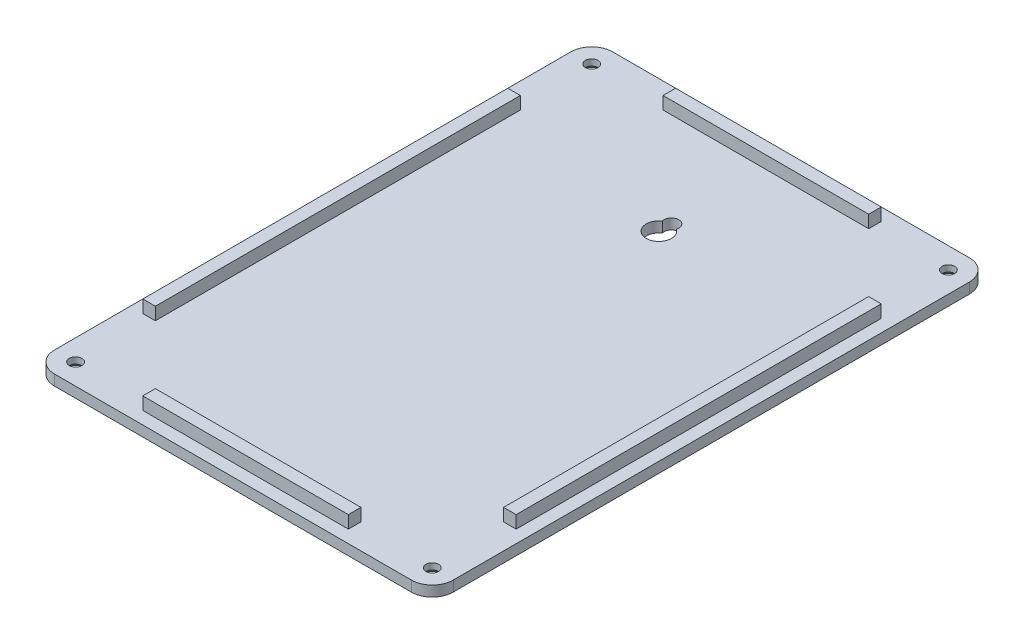
ISO-10303-21;
HEADER;
FILE_DESCRIPTION(('STEP AP214'),'2;1');
FILE_NAME('part.step','',(''),(''),'','','');
FILE_SCHEMA(('AUTOMOTIVE_DESIGN { 1 0 10303 214 1 1 1 1 }'));
ENDSEC;
DATA;
#1=APPLICATION_CONTEXT('core data for automotive mechanical design processes');
#2=APPLICATION_PROTOCOL_DEFINITION('international standard','automotive_design',2000,#1);
#3=PRODUCT_CONTEXT('',#1,'mechanical');
#4=PRODUCT('Part','Part','',(#3));
#5=PRODUCT_RELATED_PRODUCT_CATEGORY('part','',(#4));
#6=PRODUCT_DEFINITION_FORMATION('','',#4);
#7=PRODUCT_DEFINITION_CONTEXT('part definition',#1,'design');
#8=PRODUCT_DEFINITION('design','',#6,#7);
#9=PRODUCT_DEFINITION_SHAPE('','',#8);
#10=(LENGTH_UNIT() NAMED_UNIT(*) SI_UNIT(.MILLI.,.METRE.));
#11=(NAMED_UNIT(*) PLANE_ANGLE_UNIT() SI_UNIT($,.RADIAN.));
#12=(NAMED_UNIT(*) SI_UNIT($,.STERADIAN.) SOLID_ANGLE_UNIT());
#13=UNCERTAINTY_MEASURE_WITH_UNIT(LENGTH_MEASURE(1.E-05),#10,'distance_accuracy_value','');
#14=(GEOMETRIC_REPRESENTATION_CONTEXT(3) GLOBAL_UNCERTAINTY_ASSIGNED_CONTEXT((#13)) GLOBAL_UNIT_ASSIGNED_CONTEXT((#10,
#11,#12)) REPRESENTATION_CONTEXT('',''));
#15=CARTESIAN_POINT('',(0.,0.,0.));
#16=DIRECTION('',(0.,0.,1.));
#17=DIRECTION('',(1.,0.,0.));
#18=AXIS2_PLACEMENT_3D('',#15,#16,#17);
#19=CARTESIAN_POINT('',(-42.4999999999909,2.5,61.4999999999953));
#20=DIRECTION('',(0.,-1.,0.));
#21=DIRECTION('',(0.,0.,-1.));
#22=AXIS2_PLACEMENT_3D('',#19,#20,#21);
#23=PLANE('',#22);
#24=CARTESIAN_POINT('',(0.,2.5,-37.9999999999983));
#25=DIRECTION('',(0.,1.,0.));
#26=DIRECTION('',(0.,0.,-1.));
#27=AXIS2_PLACEMENT_3D('',#24,#25,#26);
#28=CIRCLE('',#27,1.75);
#29=CARTESIAN_POINT('',(1.67391004130708,2.5,-37.4895833333316));
#30=VERTEX_POINT('',#29);
#31=CARTESIAN_POINT('',(-1.67391004130721,2.5,-37.4895833333316));
#32=VERTEX_POINT('',#31);
#33=EDGE_CURVE('E212',#30,#32,#28,.T.);
#34=ORIENTED_EDGE('',*,*,#33,.F.);
#35=CARTESIAN_POINT('',(0.,2.5,-34.9999999999983));
#36=DIRECTION('',(0.,1.,0.));
#37=DIRECTION('',(0.,0.,1.));
#38=AXIS2_PLACEMENT_3D('',#35,#36,#37);
#39=CIRCLE('',#38,3.);
#40=EDGE_CURVE('E48',#32,#30,#39,.T.);
#41=ORIENTED_EDGE('',*,*,#40,.F.);
#42=EDGE_LOOP('',(#34,#41));
#43=FACE_BOUND('',#42,.T.);
#44=DIRECTION('',(-1.,0.,0.));
#45=VECTOR('',#44,1.);
#46=CARTESIAN_POINT('',(-44.4999999999933,2.5,-43.4999999999949));
#47=LINE('',#46,#45);
#48=CARTESIAN_POINT('',(-41.4999999999933,2.5,-43.4999999999949));
#49=VERTEX_POINT('',#48);
#50=CARTESIAN_POINT('',(-44.4999999999933,2.5,-43.4999999999949));
#51=VERTEX_POINT('',#50);
#52=EDGE_CURVE('E252',#49,#51,#47,.T.);
#53=ORIENTED_EDGE('',*,*,#52,.F.);
#54=DIRECTION('',(0.,0.,-1.));
#55=VECTOR('',#54,1.);
#56=CARTESIAN_POINT('',(-41.4999999999933,2.5,-43.4999999999949));
#57=LINE('',#56,#55);
#58=CARTESIAN_POINT('',(-41.4999999999933,2.5,43.4999999999949));
#59=VERTEX_POINT('',#58);
#60=EDGE_CURVE('E257',#59,#49,#57,.T.);
#61=ORIENTED_EDGE('',*,*,#60,.F.);
#62=DIRECTION('',(1.,0.,0.));
#63=VECTOR('',#62,1.);
#64=CARTESIAN_POINT('',(-44.4999999999933,2.5,43.4999999999949));
#65=LINE('',#64,#63);
#66=CARTESIAN_POINT('',(-44.4999999999933,2.5,43.4999999999949));
#67=VERTEX_POINT('',#66);
#68=EDGE_CURVE('E269',#67,#59,#65,.T.);
#69=ORIENTED_EDGE('',*,*,#68,.F.);
#70=DIRECTION('',(0.,0.,1.));
#71=VECTOR('',#70,1.);
#72=CARTESIAN_POINT('',(-44.4999999999933,2.5,-43.4999999999949));
#73=LINE('',#72,#71);
#74=EDGE_CURVE('E266',#51,#67,#73,.T.);
#75=ORIENTED_EDGE('',*,*,#74,.F.);
#76=EDGE_LOOP('',(#53,#61,#69,#75));
#77=FACE_BOUND('',#76,.T.);
#78=DIRECTION('',(0.,0.,1.));
#79=VECTOR('',#78,1.);
#80=CARTESIAN_POINT('',(-24.4999999999882,2.5,-63.5000000000001));
#81=LINE('',#80,#79);
#82=CARTESIAN_POINT('',(-24.4999999999882,2.5,-63.5000000000001));
#83=VERTEX_POINT('',#82);
#84=CARTESIAN_POINT('',(-24.4999999999882,2.5,-60.5));
#85=VERTEX_POINT('',#84);
#86=EDGE_CURVE('E318',#83,#85,#81,.T.);
#87=ORIENTED_EDGE('',*,*,#86,.F.);
#88=DIRECTION('',(-1.,0.,0.));
#89=VECTOR('',#88,1.);
#90=CARTESIAN_POINT('',(-24.4999999999882,2.5,-63.5000000000001));
#91=LINE('',#90,#89);
#92=CARTESIAN_POINT('',(24.5000000000148,2.5,-63.5000000000001));
#93=VERTEX_POINT('',#92);
#94=EDGE_CURVE('E323',#93,#83,#91,.T.);
#95=ORIENTED_EDGE('',*,*,#94,.F.);
#96=DIRECTION('',(0.,0.,-1.));
#97=VECTOR('',#96,1.);
#98=CARTESIAN_POINT('',(24.5000000000148,2.5,-60.5000000000001));
#99=LINE('',#98,#97);
#100=CARTESIAN_POINT('',(24.5000000000148,2.5,-60.5));
#101=VERTEX_POINT('',#100);
#102=EDGE_CURVE('E335',#101,#93,#99,.T.);
#103=ORIENTED_EDGE('',*,*,#102,.F.);
#104=DIRECTION('',(1.,0.,0.));
#105=VECTOR('',#104,1.);
#106=CARTESIAN_POINT('',(-24.4999999999882,2.5,-60.5000000000001));
#107=LINE('',#106,#105);
#108=EDGE_CURVE('E332',#85,#101,#107,.T.);
#109=ORIENTED_EDGE('',*,*,#108,.F.);
#110=EDGE_LOOP('',(#87,#95,#103,#109));
#111=FACE_BOUND('',#110,.T.);
#112=CARTESIAN_POINT('',(-42.4999999999886,2.5,61.4999999999953));
#113=DIRECTION('',(0.,1.,0.));
#114=DIRECTION('',(0.,0.,1.));
#115=AXIS2_PLACEMENT_3D('',#112,#113,#114);
#116=CIRCLE('',#115,1.5);
#117=CARTESIAN_POINT('',(-42.4999999999886,2.5,62.9999999999953));
#118=VERTEX_POINT('',#117);
#119=EDGE_CURVE('E351',#118,#118,#116,.T.);
#120=ORIENTED_EDGE('',*,*,#119,.F.);
#121=EDGE_LOOP('',(#120));
#122=FACE_BOUND('',#121,.T.);
#123=CARTESIAN_POINT('',(42.5000000000151,2.5,61.4999999999953));
#124=DIRECTION('',(0.,1.,0.));
#125=DIRECTION('',(0.,0.,1.));
#126=AXIS2_PLACEMENT_3D('',#123,#124,#125);
#127=CIRCLE('',#126,1.5);
#128=CARTESIAN_POINT('',(42.5000000000151,2.5,62.9999999999953));
#129=VERTEX_POINT('',#128);
#130=EDGE_CURVE('E356',#129,#129,#127,.T.);
#131=ORIENTED_EDGE('',*,*,#130,.F.);
#132=EDGE_LOOP('',(#131));
#133=FACE_BOUND('',#132,.T.);
#134=CARTESIAN_POINT('',(42.5000000000151,2.5,-61.4999999999953));
#135=DIRECTION('',(0.,1.,0.));
#136=DIRECTION('',(0.,0.,1.));
#137=AXIS2_PLACEMENT_3D('',#134,#135,#136);
#138=CIRCLE('',#137,1.5);
#139=CARTESIAN_POINT('',(42.5000000000151,2.5,-59.9999999999953));
#140=VERTEX_POINT('',#139);
#141=EDGE_CURVE('E352',#140,#140,#138,.T.);
#142=ORIENTED_EDGE('',*,*,#141,.F.);
#143=EDGE_LOOP('',(#142));
#144=FACE_BOUND('',#143,.T.);
#145=CARTESIAN_POINT('',(-42.4999999999886,2.5,-61.4999999999953));
#146=DIRECTION('',(0.,1.,0.));
#147=DIRECTION('',(0.,0.,1.));
#148=AXIS2_PLACEMENT_3D('',#145,#146,#147);
#149=CIRCLE('',#148,1.5);
#150=CARTESIAN_POINT('',(-42.4999999999886,2.5,-59.9999999999953));
#151=VERTEX_POINT('',#150);
#152=EDGE_CURVE('E355',#151,#151,#149,.T.);
#153=ORIENTED_EDGE('',*,*,#152,.F.);
#154=EDGE_LOOP('',(#153));
#155=FACE_BOUND('',#154,.T.);
#156=CARTESIAN_POINT('',(-42.4999999999909,2.5,61.4999999999953));
#157=DIRECTION('',(0.,1.,0.));
#158=DIRECTION('',(0.,0.,-1.));
#159=AXIS2_PLACEMENT_3D('',#156,#157,#158);
#160=CIRCLE('',#159,5.);
#161=CARTESIAN_POINT('',(-47.4999999999909,2.5,61.4999999999953));
#162=VERTEX_POINT('',#161);
#163=CARTESIAN_POINT('',(-42.4999999999908,2.5,66.4999999999953));
#164=VERTEX_POINT('',#163);
#165=EDGE_CURVE('E364',#162,#164,#160,.T.);
#166=ORIENTED_EDGE('',*,*,#165,.T.);
#167=DIRECTION('',(1.,0.,0.));
#168=VECTOR('',#167,1.);
#169=CARTESIAN_POINT('',(-42.4999999999908,2.5,66.4999999999953));
#170=LINE('',#169,#168);
#171=CARTESIAN_POINT('',(42.5000000000085,2.5,66.4999999999953));
#172=VERTEX_POINT('',#171);
#173=EDGE_CURVE('E367',#164,#172,#170,.T.);
#174=ORIENTED_EDGE('',*,*,#173,.T.);
#175=CARTESIAN_POINT('',(42.5000000000086,2.5,61.4999999999953));
#176=DIRECTION('',(0.,1.,0.));
#177=DIRECTION('',(0.,0.,1.));
#178=AXIS2_PLACEMENT_3D('',#175,#176,#177);
#179=CIRCLE('',#178,5.);
#180=CARTESIAN_POINT('',(47.5000000000086,2.5,61.4999999999953));
#181=VERTEX_POINT('',#180);
#182=EDGE_CURVE('E370',#172,#181,#179,.T.);
#183=ORIENTED_EDGE('',*,*,#182,.T.);
#184=DIRECTION('',(0.,0.,-1.));
#185=VECTOR('',#184,1.);
#186=CARTESIAN_POINT('',(47.5000000000086,2.5,61.4999999999953));
#187=LINE('',#186,#185);
#188=CARTESIAN_POINT('',(47.5000000000086,2.5,-61.4999999999953));
#189=VERTEX_POINT('',#188);
#190=EDGE_CURVE('E372',#181,#189,#187,.T.);
#191=ORIENTED_EDGE('',*,*,#190,.T.);
#192=CARTESIAN_POINT('',(42.5000000000086,2.5,-61.4999999999953));
#193=DIRECTION('',(0.,1.,0.));
#194=DIRECTION('',(0.,0.,1.));
#195=AXIS2_PLACEMENT_3D('',#192,#193,#194);
#196=CIRCLE('',#195,5.);
#197=CARTESIAN_POINT('',(42.5000000000085,2.5,-66.4999999999953));
#198=VERTEX_POINT('',#197);
#199=EDGE_CURVE('E374',#189,#198,#196,.T.);
#200=ORIENTED_EDGE('',*,*,#199,.T.);
#201=DIRECTION('',(-1.,0.,0.));
#202=VECTOR('',#201,1.);
#203=CARTESIAN_POINT('',(42.5000000000085,2.5,-66.4999999999953));
#204=LINE('',#203,#202);
#205=CARTESIAN_POINT('',(-42.4999999999908,2.5,-66.4999999999953));
#206=VERTEX_POINT('',#205);
#207=EDGE_CURVE('E376',#198,#206,#204,.T.);
#208=ORIENTED_EDGE('',*,*,#207,.T.);
#209=CARTESIAN_POINT('',(-42.4999999999909,2.5,-61.4999999999953));
#210=DIRECTION('',(0.,1.,0.));
#211=DIRECTION('',(0.,0.,1.));
#212=AXIS2_PLACEMENT_3D('',#209,#210,#211);
#213=CIRCLE('',#212,5.);
#214=CARTESIAN_POINT('',(-47.4999999999909,2.5,-61.4999999999953));
#215=VERTEX_POINT('',#214);
#216=EDGE_CURVE('E378',#206,#215,#213,.T.);
#217=ORIENTED_EDGE('',*,*,#216,.T.);
#218=DIRECTION('',(0.,0.,1.));
#219=VECTOR('',#218,1.);
#220=CARTESIAN_POINT('',(-47.4999999999909,2.5,-61.4999999999953));
#221=LINE('',#220,#219);
#222=EDGE_CURVE('E380',#215,#162,#221,.T.);
#223=ORIENTED_EDGE('',*,*,#222,.T.);
#224=EDGE_LOOP('',(#166,#174,#183,#191,#200,#208,#217,#223));
#225=FACE_BOUND('',#224,.T.);
#226=DIRECTION('',(0.,0.,1.));
#227=VECTOR('',#226,1.);
#228=CARTESIAN_POINT('',(-24.4999999999882,2.5,63.5000000000001));
#229=LINE('',#228,#227);
#230=CARTESIAN_POINT('',(-24.4999999999882,2.5,60.5000000000001));
#231=VERTEX_POINT('',#230);
#232=CARTESIAN_POINT('',(-24.4999999999882,2.5,63.5000000000001));
#233=VERTEX_POINT('',#232);
#234=EDGE_CURVE('E285',#231,#233,#229,.T.);
#235=ORIENTED_EDGE('',*,*,#234,.F.);
#236=DIRECTION('',(-1.,0.,0.));
#237=VECTOR('',#236,1.);
#238=CARTESIAN_POINT('',(-24.4999999999882,2.5,60.5000000000001));
#239=LINE('',#238,#237);
#240=CARTESIAN_POINT('',(24.5000000000148,2.5,60.5000000000001));
#241=VERTEX_POINT('',#240);
#242=EDGE_CURVE('E290',#241,#231,#239,.T.);
#243=ORIENTED_EDGE('',*,*,#242,.F.);
#244=DIRECTION('',(0.,0.,-1.));
#245=VECTOR('',#244,1.);
#246=CARTESIAN_POINT('',(24.5000000000148,2.5,63.5000000000001));
#247=LINE('',#246,#245);
#248=CARTESIAN_POINT('',(24.5000000000148,2.5,63.5000000000001));
#249=VERTEX_POINT('',#248);
#250=EDGE_CURVE('E302',#249,#241,#247,.T.);
#251=ORIENTED_EDGE('',*,*,#250,.F.);
#252=DIRECTION('',(1.,0.,0.));
#253=VECTOR('',#252,1.);
#254=CARTESIAN_POINT('',(-24.4999999999882,2.5,63.5000000000001));
#255=LINE('',#254,#253);
#256=EDGE_CURVE('E299',#233,#249,#255,.T.);
#257=ORIENTED_EDGE('',*,*,#256,.F.);
#258=EDGE_LOOP('',(#235,#243,#251,#257));
#259=FACE_BOUND('',#258,.T.);
#260=DIRECTION('',(-1.,0.,0.));
#261=VECTOR('',#260,1.);
#262=CARTESIAN_POINT('',(41.5000000000057,2.5,-43.4999999999949));
#263=LINE('',#262,#261);
#264=CARTESIAN_POINT('',(44.5000000000057,2.5,-43.4999999999949));
#265=VERTEX_POINT('',#264);
#266=CARTESIAN_POINT('',(41.5000000000057,2.5,-43.4999999999949));
#267=VERTEX_POINT('',#266);
#268=EDGE_CURVE('E208',#265,#267,#263,.T.);
#269=ORIENTED_EDGE('',*,*,#268,.F.);
#270=DIRECTION('',(0.,0.,-1.));
#271=VECTOR('',#270,1.);
#272=CARTESIAN_POINT('',(44.5000000000057,2.5,-43.4999999999949));
#273=LINE('',#272,#271);
#274=CARTESIAN_POINT('',(44.5000000000057,2.5,43.4999999999949));
#275=VERTEX_POINT('',#274);
#276=EDGE_CURVE('E224',#275,#265,#273,.T.);
#277=ORIENTED_EDGE('',*,*,#276,.F.);
#278=DIRECTION('',(1.,0.,0.));
#279=VECTOR('',#278,1.);
#280=CARTESIAN_POINT('',(41.5000000000057,2.5,43.4999999999949));
#281=LINE('',#280,#279);
#282=CARTESIAN_POINT('',(41.5000000000057,2.5,43.4999999999949));
#283=VERTEX_POINT('',#282);
#284=EDGE_CURVE('E236',#283,#275,#281,.T.);
#285=ORIENTED_EDGE('',*,*,#284,.F.);
#286=DIRECTION('',(0.,0.,1.));
#287=VECTOR('',#286,1.);
#288=CARTESIAN_POINT('',(41.5000000000057,2.5,-43.4999999999949));
#289=LINE('',#288,#287);
#290=EDGE_CURVE('E233',#267,#283,#289,.T.);
#291=ORIENTED_EDGE('',*,*,#290,.F.);
#292=EDGE_LOOP('',(#269,#277,#285,#291));
#293=FACE_BOUND('',#292,.T.);
#294=ADVANCED_FACE('F33',(#43,#77,#111,#122,#133,#144,#155,#225,#259,#293),#23,.F.);
#295=CARTESIAN_POINT('',(-42.4999999999909,2.5,61.4999999999953));
#296=DIRECTION('',(0.,-1.,0.));
#297=DIRECTION('',(0.,0.,-1.));
#298=AXIS2_PLACEMENT_3D('',#295,#296,#297);
#299=CYLINDRICAL_SURFACE('',#298,5.);
#300=CARTESIAN_POINT('',(-42.4999999999909,0.,61.4999999999953));
#301=DIRECTION('',(0.,1.,0.));
#302=DIRECTION('',(0.,0.,-1.));
#303=AXIS2_PLACEMENT_3D('',#300,#301,#302);
#304=CIRCLE('',#303,5.);
#305=CARTESIAN_POINT('',(-47.4999999999909,0.,61.4999999999953));
#306=VERTEX_POINT('',#305);
#307=CARTESIAN_POINT('',(-42.4999999999908,0.,66.4999999999953));
#308=VERTEX_POINT('',#307);
#309=EDGE_CURVE('E363',#306,#308,#304,.T.);
#310=ORIENTED_EDGE('',*,*,#309,.T.);
#311=DIRECTION('',(0.,-1.,0.));
#312=VECTOR('',#311,1.);
#313=CARTESIAN_POINT('',(-42.4999999999908,2.5,66.4999999999953));
#314=LINE('',#313,#312);
#315=EDGE_CURVE('E418',#164,#308,#314,.T.);
#316=ORIENTED_EDGE('',*,*,#315,.F.);
#317=ORIENTED_EDGE('',*,*,#165,.F.);
#318=DIRECTION('',(0.,-1.,0.));
#319=VECTOR('',#318,1.);
#320=CARTESIAN_POINT('',(-47.4999999999909,2.5,61.4999999999953));
#321=LINE('',#320,#319);
#322=EDGE_CURVE('E382',#162,#306,#321,.T.);
#323=ORIENTED_EDGE('',*,*,#322,.T.);
#324=EDGE_LOOP('',(#310,#316,#317,#323));
#325=FACE_BOUND('',#324,.T.);
#326=ADVANCED_FACE('F461',(#325),#299,.T.);
#327=CARTESIAN_POINT('',(-42.4999999999908,2.5,66.4999999999953));
#328=DIRECTION('',(0.,0.,-1.));
#329=DIRECTION('',(-1.,0.,0.));
#330=AXIS2_PLACEMENT_3D('',#327,#328,#329);
#331=PLANE('',#330);
#332=DIRECTION('',(1.,0.,0.));
#333=VECTOR('',#332,1.);
#334=CARTESIAN_POINT('',(-42.4999999999908,0.,66.4999999999953));
#335=LINE('',#334,#333);
#336=CARTESIAN_POINT('',(42.5000000000085,0.,66.4999999999953));
#337=VERTEX_POINT('',#336);
#338=EDGE_CURVE('E385',#308,#337,#335,.T.);
#339=ORIENTED_EDGE('',*,*,#338,.T.);
#340=DIRECTION('',(0.,-1.,0.));
#341=VECTOR('',#340,1.);
#342=CARTESIAN_POINT('',(42.5000000000085,2.5,66.4999999999953));
#343=LINE('',#342,#341);
#344=EDGE_CURVE('E415',#172,#337,#343,.T.);
#345=ORIENTED_EDGE('',*,*,#344,.F.);
#346=ORIENTED_EDGE('',*,*,#173,.F.);
#347=ORIENTED_EDGE('',*,*,#315,.T.);
#348=EDGE_LOOP('',(#339,#345,#346,#347));
#349=FACE_BOUND('',#348,.T.);
#350=ADVANCED_FACE('F468',(#349),#331,.F.);
#351=CARTESIAN_POINT('',(42.5000000000086,2.5,61.4999999999953));
#352=DIRECTION('',(0.,-1.,0.));
#353=DIRECTION('',(0.,0.,-1.));
#354=AXIS2_PLACEMENT_3D('',#351,#352,#353);
#355=CYLINDRICAL_SURFACE('',#354,5.);
#356=CARTESIAN_POINT('',(42.5000000000086,0.,61.4999999999953));
#357=DIRECTION('',(0.,1.,0.));
#358=DIRECTION('',(0.,0.,1.));
#359=AXIS2_PLACEMENT_3D('',#356,#357,#358);
#360=CIRCLE('',#359,5.);
#361=CARTESIAN_POINT('',(47.5000000000086,0.,61.4999999999953));
#362=VERTEX_POINT('',#361);
#363=EDGE_CURVE('E387',#337,#362,#360,.T.);
#364=ORIENTED_EDGE('',*,*,#363,.T.);
#365=DIRECTION('',(0.,-1.,0.));
#366=VECTOR('',#365,1.);
#367=CARTESIAN_POINT('',(47.5000000000086,2.5,61.4999999999953));
#368=LINE('',#367,#366);
#369=EDGE_CURVE('E412',#181,#362,#368,.T.);
#370=ORIENTED_EDGE('',*,*,#369,.F.);
#371=ORIENTED_EDGE('',*,*,#182,.F.);
#372=ORIENTED_EDGE('',*,*,#344,.T.);
#373=EDGE_LOOP('',(#364,#370,#371,#372));
#374=FACE_BOUND('',#373,.T.);
#375=ADVANCED_FACE('F497',(#374),#355,.T.);
#376=CARTESIAN_POINT('',(47.5000000000086,2.5,61.4999999999953));
#377=DIRECTION('',(-1.,0.,0.));
#378=DIRECTION('',(0.,0.,1.));
#379=AXIS2_PLACEMENT_3D('',#376,#377,#378);
#380=PLANE('',#379);
#381=DIRECTION('',(0.,0.,-1.));
#382=VECTOR('',#381,1.);
#383=CARTESIAN_POINT('',(47.5000000000086,0.,61.4999999999953));
#384=LINE('',#383,#382);
#385=CARTESIAN_POINT('',(47.5000000000086,0.,-61.4999999999953));
#386=VERTEX_POINT('',#385);
#387=EDGE_CURVE('E389',#362,#386,#384,.T.);
#388=ORIENTED_EDGE('',*,*,#387,.T.);
#389=DIRECTION('',(0.,-1.,0.));
#390=VECTOR('',#389,1.);
#391=CARTESIAN_POINT('',(47.5000000000086,2.5,-61.4999999999953));
#392=LINE('',#391,#390);
#393=EDGE_CURVE('E409',#189,#386,#392,.T.);
#394=ORIENTED_EDGE('',*,*,#393,.F.);
#395=ORIENTED_EDGE('',*,*,#190,.F.);
#396=ORIENTED_EDGE('',*,*,#369,.T.);
#397=EDGE_LOOP('',(#388,#394,#395,#396));
#398=FACE_BOUND('',#397,.T.);
#399=ADVANCED_FACE('F493',(#398),#380,.F.);
#400=CARTESIAN_POINT('',(42.5000000000086,2.5,-61.4999999999953));
#401=DIRECTION('',(0.,-1.,0.));
#402=DIRECTION('',(0.,0.,-1.));
#403=AXIS2_PLACEMENT_3D('',#400,#401,#402);
#404=CYLINDRICAL_SURFACE('',#403,5.);
#405=CARTESIAN_POINT('',(42.5000000000086,0.,-61.4999999999953));
#406=DIRECTION('',(0.,1.,0.));
#407=DIRECTION('',(0.,0.,1.));
#408=AXIS2_PLACEMENT_3D('',#405,#406,#407);
#409=CIRCLE('',#408,5.);
#410=CARTESIAN_POINT('',(42.5000000000085,0.,-66.4999999999953));
#411=VERTEX_POINT('',#410);
#412=EDGE_CURVE('E391',#386,#411,#409,.T.);
#413=ORIENTED_EDGE('',*,*,#412,.T.);
#414=DIRECTION('',(0.,-1.,0.));
#415=VECTOR('',#414,1.);
#416=CARTESIAN_POINT('',(42.5000000000085,2.5,-66.4999999999953));
#417=LINE('',#416,#415);
#418=EDGE_CURVE('E406',#198,#411,#417,.T.);
#419=ORIENTED_EDGE('',*,*,#418,.F.);
#420=ORIENTED_EDGE('',*,*,#199,.F.);
#421=ORIENTED_EDGE('',*,*,#393,.T.);
#422=EDGE_LOOP('',(#413,#419,#420,#421));
#423=FACE_BOUND('',#422,.T.);
#424=ADVANCED_FACE('F489',(#423),#404,.T.);
#425=CARTESIAN_POINT('',(42.5000000000085,2.5,-66.4999999999953));
#426=DIRECTION('',(0.,0.,1.));
#427=DIRECTION('',(1.,0.,0.));
#428=AXIS2_PLACEMENT_3D('',#425,#426,#427);
#429=PLANE('',#428);
#430=DIRECTION('',(-1.,0.,0.));
#431=VECTOR('',#430,1.);
#432=CARTESIAN_POINT('',(42.5000000000085,0.,-66.4999999999953));
#433=LINE('',#432,#431);
#434=CARTESIAN_POINT('',(-42.4999999999908,0.,-66.4999999999953));
#435=VERTEX_POINT('',#434);
#436=EDGE_CURVE('E393',#411,#435,#433,.T.);
#437=ORIENTED_EDGE('',*,*,#436,.T.);
#438=DIRECTION('',(0.,-1.,0.));
#439=VECTOR('',#438,1.);
#440=CARTESIAN_POINT('',(-42.4999999999908,2.5,-66.4999999999953));
#441=LINE('',#440,#439);
#442=EDGE_CURVE('E403',#206,#435,#441,.T.);
#443=ORIENTED_EDGE('',*,*,#442,.F.);
#444=ORIENTED_EDGE('',*,*,#207,.F.);
#445=ORIENTED_EDGE('',*,*,#418,.T.);
#446=EDGE_LOOP('',(#437,#443,#444,#445));
#447=FACE_BOUND('',#446,.T.);
#448=ADVANCED_FACE('F485',(#447),#429,.F.);
#449=CARTESIAN_POINT('',(-42.4999999999909,2.5,-61.4999999999953));
#450=DIRECTION('',(0.,-1.,0.));
#451=DIRECTION('',(0.,0.,-1.));
#452=AXIS2_PLACEMENT_3D('',#449,#450,#451);
#453=CYLINDRICAL_SURFACE('',#452,5.);
#454=CARTESIAN_POINT('',(-42.4999999999909,0.,-61.4999999999953));
#455=DIRECTION('',(0.,1.,0.));
#456=DIRECTION('',(0.,0.,1.));
#457=AXIS2_PLACEMENT_3D('',#454,#455,#456);
#458=CIRCLE('',#457,5.);
#459=CARTESIAN_POINT('',(-47.4999999999909,0.,-61.4999999999953));
#460=VERTEX_POINT('',#459);
#461=EDGE_CURVE('E395',#435,#460,#458,.T.);
#462=ORIENTED_EDGE('',*,*,#461,.T.);
#463=DIRECTION('',(0.,-1.,0.));
#464=VECTOR('',#463,1.);
#465=CARTESIAN_POINT('',(-47.4999999999909,2.5,-61.4999999999953));
#466=LINE('',#465,#464);
#467=EDGE_CURVE('E400',#215,#460,#466,.T.);
#468=ORIENTED_EDGE('',*,*,#467,.F.);
#469=ORIENTED_EDGE('',*,*,#216,.F.);
#470=ORIENTED_EDGE('',*,*,#442,.T.);
#471=EDGE_LOOP('',(#462,#468,#469,#470));
#472=FACE_BOUND('',#471,.T.);
#473=ADVANCED_FACE('F481',(#472),#453,.T.);
#474=CARTESIAN_POINT('',(-47.4999999999909,2.5,-61.4999999999953));
#475=DIRECTION('',(1.,0.,0.));
#476=DIRECTION('',(0.,0.,-1.));
#477=AXIS2_PLACEMENT_3D('',#474,#475,#476);
#478=PLANE('',#477);
#479=DIRECTION('',(0.,0.,1.));
#480=VECTOR('',#479,1.);
#481=CARTESIAN_POINT('',(-47.4999999999909,0.,-61.4999999999953));
#482=LINE('',#481,#480);
#483=EDGE_CURVE('E368',#460,#306,#482,.T.);
#484=ORIENTED_EDGE('',*,*,#483,.T.);
#485=ORIENTED_EDGE('',*,*,#322,.F.);
#486=ORIENTED_EDGE('',*,*,#222,.F.);
#487=ORIENTED_EDGE('',*,*,#467,.T.);
#488=EDGE_LOOP('',(#484,#485,#486,#487));
#489=FACE_BOUND('',#488,.T.);
#490=ADVANCED_FACE('F477',(#489),#478,.F.);
#491=CARTESIAN_POINT('',(-42.4999999999909,0.,61.4999999999953));
#492=DIRECTION('',(0.,-1.,0.));
#493=DIRECTION('',(0.,0.,-1.));
#494=AXIS2_PLACEMENT_3D('',#491,#492,#493);
#495=PLANE('',#494);
#496=CARTESIAN_POINT('',(-42.4999999999886,0.,61.4999999999953));
#497=DIRECTION('',(0.,-1.,0.));
#498=DIRECTION('',(0.,0.,-1.));
#499=AXIS2_PLACEMENT_3D('',#496,#497,#498);
#500=CIRCLE('',#499,2.50000000000003);
#501=CARTESIAN_POINT('',(-42.4999999999886,0.,58.9999999999953));
#502=VERTEX_POINT('',#501);
#503=EDGE_CURVE('E436',#502,#502,#500,.F.);
#504=ORIENTED_EDGE('',*,*,#503,.T.);
#505=EDGE_LOOP('',(#504));
#506=FACE_BOUND('',#505,.T.);
#507=CARTESIAN_POINT('',(42.5000000000151,0.,61.4999999999953));
#508=DIRECTION('',(0.,-1.,0.));
#509=DIRECTION('',(0.,0.,-1.));
#510=AXIS2_PLACEMENT_3D('',#507,#508,#509);
#511=CIRCLE('',#510,2.50000000000003);
#512=CARTESIAN_POINT('',(42.5000000000151,0.,58.9999999999953));
#513=VERTEX_POINT('',#512);
#514=EDGE_CURVE('E433',#513,#513,#511,.F.);
#515=ORIENTED_EDGE('',*,*,#514,.T.);
#516=EDGE_LOOP('',(#515));
#517=FACE_BOUND('',#516,.T.);
#518=CARTESIAN_POINT('',(-42.4999999999886,0.,-61.4999999999953));
#519=DIRECTION('',(0.,-1.,0.));
#520=DIRECTION('',(0.,0.,-1.));
#521=AXIS2_PLACEMENT_3D('',#518,#519,#520);
#522=CIRCLE('',#521,2.49999999999999);
#523=CARTESIAN_POINT('',(-42.4999999999886,0.,-63.9999999999953));
#524=VERTEX_POINT('',#523);
#525=EDGE_CURVE('E430',#524,#524,#522,.F.);
#526=ORIENTED_EDGE('',*,*,#525,.T.);
#527=EDGE_LOOP('',(#526));
#528=FACE_BOUND('',#527,.T.);
#529=CARTESIAN_POINT('',(42.5000000000151,0.,-61.4999999999953));
#530=DIRECTION('',(0.,-1.,0.));
#531=DIRECTION('',(0.,0.,-1.));
#532=AXIS2_PLACEMENT_3D('',#529,#530,#531);
#533=CIRCLE('',#532,2.49999999999999);
#534=CARTESIAN_POINT('',(42.5000000000151,0.,-63.9999999999953));
#535=VERTEX_POINT('',#534);
#536=EDGE_CURVE('E427',#535,#535,#533,.F.);
#537=ORIENTED_EDGE('',*,*,#536,.T.);
#538=EDGE_LOOP('',(#537));
#539=FACE_BOUND('',#538,.T.);
#540=CARTESIAN_POINT('',(0.,0.,-34.9999999999983));
#541=DIRECTION('',(0.,-1.,0.));
#542=DIRECTION('',(0.,0.,-1.));
#543=AXIS2_PLACEMENT_3D('',#540,#541,#542);
#544=CIRCLE('',#543,3.);
#545=CARTESIAN_POINT('',(1.67391004130708,0.,-37.4895833333316));
#546=VERTEX_POINT('',#545);
#547=CARTESIAN_POINT('',(-1.67391004130721,0.,-37.4895833333316));
#548=VERTEX_POINT('',#547);
#549=EDGE_CURVE('E206',#546,#548,#544,.T.);
#550=ORIENTED_EDGE('',*,*,#549,.F.);
#551=CARTESIAN_POINT('',(0.,0.,-37.9999999999983));
#552=DIRECTION('',(0.,-1.,0.));
#553=DIRECTION('',(0.,0.,-1.));
#554=AXIS2_PLACEMENT_3D('',#551,#552,#553);
#555=CIRCLE('',#554,1.75);
#556=EDGE_CURVE('E421',#548,#546,#555,.T.);
#557=ORIENTED_EDGE('',*,*,#556,.F.);
#558=EDGE_LOOP('',(#550,#557));
#559=FACE_BOUND('',#558,.T.);
#560=ORIENTED_EDGE('',*,*,#309,.F.);
#561=ORIENTED_EDGE('',*,*,#483,.F.);
#562=ORIENTED_EDGE('',*,*,#461,.F.);
#563=ORIENTED_EDGE('',*,*,#436,.F.);
#564=ORIENTED_EDGE('',*,*,#412,.F.);
#565=ORIENTED_EDGE('',*,*,#387,.F.);
#566=ORIENTED_EDGE('',*,*,#363,.F.);
#567=ORIENTED_EDGE('',*,*,#338,.F.);
#568=EDGE_LOOP('',(#560,#561,#562,#563,#564,#565,#566,#567));
#569=FACE_BOUND('',#568,.T.);
#570=ADVANCED_FACE('F474',(#506,#517,#528,#539,#559,#569),#495,.T.);
#571=CARTESIAN_POINT('',(-42.4999999999886,-8.5,-61.4999999999953));
#572=DIRECTION('',(0.,1.,0.));
#573=DIRECTION('',(0.,0.,1.));
#574=AXIS2_PLACEMENT_3D('',#571,#572,#573);
#575=CYLINDRICAL_SURFACE('',#574,1.5);
#576=CARTESIAN_POINT('',(-42.4999999999886,0.999999999999989,-61.4999999999953));
#577=DIRECTION('',(0.,-1.,0.));
#578=DIRECTION('',(0.,0.,-1.));
#579=AXIS2_PLACEMENT_3D('',#576,#577,#578);
#580=CIRCLE('',#579,1.5);
#581=CARTESIAN_POINT('',(-42.4999999999886,0.999999999999989,-62.9999999999953));
#582=VERTEX_POINT('',#581);
#583=EDGE_CURVE('E41',#582,#582,#580,.T.);
#584=ORIENTED_EDGE('',*,*,#583,.T.);
#585=EDGE_LOOP('',(#584));
#586=FACE_BOUND('',#585,.T.);
#587=ORIENTED_EDGE('',*,*,#152,.T.);
#588=EDGE_LOOP('',(#587));
#589=FACE_BOUND('',#588,.T.);
#590=ADVANCED_FACE('F444',(#586,#589),#575,.F.);
#591=CARTESIAN_POINT('',(42.5000000000151,-8.5,-61.4999999999953));
#592=DIRECTION('',(0.,1.,0.));
#593=DIRECTION('',(0.,0.,1.));
#594=AXIS2_PLACEMENT_3D('',#591,#592,#593);
#595=CYLINDRICAL_SURFACE('',#594,1.5);
#596=CARTESIAN_POINT('',(42.5000000000151,0.999999999999989,-61.4999999999953));
#597=DIRECTION('',(0.,-1.,0.));
#598=DIRECTION('',(0.,0.,-1.));
#599=AXIS2_PLACEMENT_3D('',#596,#597,#598);
#600=CIRCLE('',#599,1.5);
#601=CARTESIAN_POINT('',(42.5000000000151,0.999999999999989,-62.9999999999953));
#602=VERTEX_POINT('',#601);
#603=EDGE_CURVE('E11',#602,#602,#600,.T.);
#604=ORIENTED_EDGE('',*,*,#603,.T.);
#605=EDGE_LOOP('',(#604));
#606=FACE_BOUND('',#605,.T.);
#607=ORIENTED_EDGE('',*,*,#141,.T.);
#608=EDGE_LOOP('',(#607));
#609=FACE_BOUND('',#608,.T.);
#610=ADVANCED_FACE('F619',(#606,#609),#595,.F.);
#611=CARTESIAN_POINT('',(42.5000000000151,-8.5,61.4999999999953));
#612=DIRECTION('',(0.,1.,0.));
#613=DIRECTION('',(0.,0.,1.));
#614=AXIS2_PLACEMENT_3D('',#611,#612,#613);
#615=CYLINDRICAL_SURFACE('',#614,1.5);
#616=CARTESIAN_POINT('',(42.5000000000151,1.00000000000003,61.4999999999953));
#617=DIRECTION('',(0.,-1.,0.));
#618=DIRECTION('',(0.,0.,-1.));
#619=AXIS2_PLACEMENT_3D('',#616,#617,#618);
#620=CIRCLE('',#619,1.5);
#621=CARTESIAN_POINT('',(42.5000000000151,1.00000000000003,59.9999999999953));
#622=VERTEX_POINT('',#621);
#623=EDGE_CURVE('E439',#622,#622,#620,.T.);
#624=ORIENTED_EDGE('',*,*,#623,.T.);
#625=EDGE_LOOP('',(#624));
#626=FACE_BOUND('',#625,.T.);
#627=ORIENTED_EDGE('',*,*,#130,.T.);
#628=EDGE_LOOP('',(#627));
#629=FACE_BOUND('',#628,.T.);
#630=ADVANCED_FACE('F519',(#626,#629),#615,.F.);
#631=CARTESIAN_POINT('',(-42.4999999999886,-8.5,61.4999999999953));
#632=DIRECTION('',(0.,1.,0.));
#633=DIRECTION('',(0.,0.,1.));
#634=AXIS2_PLACEMENT_3D('',#631,#632,#633);
#635=CYLINDRICAL_SURFACE('',#634,1.5);
#636=CARTESIAN_POINT('',(-42.4999999999886,1.00000000000003,61.4999999999953));
#637=DIRECTION('',(0.,-1.,0.));
#638=DIRECTION('',(0.,0.,-1.));
#639=AXIS2_PLACEMENT_3D('',#636,#637,#638);
#640=CIRCLE('',#639,1.5);
#641=CARTESIAN_POINT('',(-42.4999999999886,1.00000000000003,59.9999999999953));
#642=VERTEX_POINT('',#641);
#643=EDGE_CURVE('E424',#642,#642,#640,.T.);
#644=ORIENTED_EDGE('',*,*,#643,.T.);
#645=EDGE_LOOP('',(#644));
#646=FACE_BOUND('',#645,.T.);
#647=ORIENTED_EDGE('',*,*,#119,.T.);
#648=EDGE_LOOP('',(#647));
#649=FACE_BOUND('',#648,.T.);
#650=ADVANCED_FACE('F515',(#646,#649),#635,.F.);
#651=CARTESIAN_POINT('',(-24.4999999999882,5.5,-63.5000000000001));
#652=DIRECTION('',(1.,0.,0.));
#653=DIRECTION('',(0.,0.,-1.));
#654=AXIS2_PLACEMENT_3D('',#651,#652,#653);
#655=PLANE('',#654);
#656=ORIENTED_EDGE('',*,*,#86,.T.);
#657=DIRECTION('',(0.,-1.,0.));
#658=VECTOR('',#657,1.);
#659=CARTESIAN_POINT('',(-24.4999999999882,5.5,-60.5000000000001));
#660=LINE('',#659,#658);
#661=CARTESIAN_POINT('',(-24.4999999999882,5.5,-60.5000000000001));
#662=VERTEX_POINT('',#661);
#663=EDGE_CURVE('E348',#662,#85,#660,.T.);
#664=ORIENTED_EDGE('',*,*,#663,.F.);
#665=DIRECTION('',(0.,0.,1.));
#666=VECTOR('',#665,1.);
#667=CARTESIAN_POINT('',(-24.4999999999882,5.5,-63.5000000000001));
#668=LINE('',#667,#666);
#669=CARTESIAN_POINT('',(-24.4999999999882,5.5,-63.5000000000001));
#670=VERTEX_POINT('',#669);
#671=EDGE_CURVE('E319',#670,#662,#668,.T.);
#672=ORIENTED_EDGE('',*,*,#671,.F.);
#673=DIRECTION('',(0.,-1.,0.));
#674=VECTOR('',#673,1.);
#675=CARTESIAN_POINT('',(-24.4999999999882,5.5,-63.5000000000001));
#676=LINE('',#675,#674);
#677=EDGE_CURVE('E329',#670,#83,#676,.T.);
#678=ORIENTED_EDGE('',*,*,#677,.T.);
#679=EDGE_LOOP('',(#656,#664,#672,#678));
#680=FACE_BOUND('',#679,.T.);
#681=ADVANCED_FACE('F518',(#680),#655,.F.);
#682=CARTESIAN_POINT('',(-24.4999999999882,5.5,-60.5000000000001));
#683=DIRECTION('',(0.,0.,-1.));
#684=DIRECTION('',(-1.,0.,0.));
#685=AXIS2_PLACEMENT_3D('',#682,#683,#684);
#686=PLANE('',#685);
#687=ORIENTED_EDGE('',*,*,#108,.T.);
#688=DIRECTION('',(0.,-1.,0.));
#689=VECTOR('',#688,1.);
#690=CARTESIAN_POINT('',(24.5000000000148,5.5,-60.5000000000001));
#691=LINE('',#690,#689);
#692=CARTESIAN_POINT('',(24.5000000000148,5.5,-60.5000000000001));
#693=VERTEX_POINT('',#692);
#694=EDGE_CURVE('E345',#693,#101,#691,.T.);
#695=ORIENTED_EDGE('',*,*,#694,.F.);
#696=DIRECTION('',(1.,0.,0.));
#697=VECTOR('',#696,1.);
#698=CARTESIAN_POINT('',(-24.4999999999882,5.5,-60.5000000000001));
#699=LINE('',#698,#697);
#700=EDGE_CURVE('E322',#662,#693,#699,.T.);
#701=ORIENTED_EDGE('',*,*,#700,.F.);
#702=ORIENTED_EDGE('',*,*,#663,.T.);
#703=EDGE_LOOP('',(#687,#695,#701,#702));
#704=FACE_BOUND('',#703,.T.);
#705=ADVANCED_FACE('F611',(#704),#686,.F.);
#706=CARTESIAN_POINT('',(24.5000000000148,5.5,-60.5000000000001));
#707=DIRECTION('',(-1.,0.,0.));
#708=DIRECTION('',(0.,0.,1.));
#709=AXIS2_PLACEMENT_3D('',#706,#707,#708);
#710=PLANE('',#709);
#711=ORIENTED_EDGE('',*,*,#102,.T.);
#712=DIRECTION('',(0.,-1.,0.));
#713=VECTOR('',#712,1.);
#714=CARTESIAN_POINT('',(24.5000000000148,5.5,-63.5000000000001));
#715=LINE('',#714,#713);
#716=CARTESIAN_POINT('',(24.5000000000148,5.5,-63.5000000000001));
#717=VERTEX_POINT('',#716);
#718=EDGE_CURVE('E342',#717,#93,#715,.T.);
#719=ORIENTED_EDGE('',*,*,#718,.F.);
#720=DIRECTION('',(0.,0.,-1.));
#721=VECTOR('',#720,1.);
#722=CARTESIAN_POINT('',(24.5000000000148,5.5,-60.5000000000001));
#723=LINE('',#722,#721);
#724=EDGE_CURVE('E325',#693,#717,#723,.T.);
#725=ORIENTED_EDGE('',*,*,#724,.F.);
#726=ORIENTED_EDGE('',*,*,#694,.T.);
#727=EDGE_LOOP('',(#711,#719,#725,#726));
#728=FACE_BOUND('',#727,.T.);
#729=ADVANCED_FACE('F607',(#728),#710,.F.);
#730=CARTESIAN_POINT('',(-24.4999999999882,5.5,-63.5000000000001));
#731=DIRECTION('',(0.,0.,1.));
#732=DIRECTION('',(1.,0.,0.));
#733=AXIS2_PLACEMENT_3D('',#730,#731,#732);
#734=PLANE('',#733);
#735=ORIENTED_EDGE('',*,*,#94,.T.);
#736=ORIENTED_EDGE('',*,*,#677,.F.);
#737=DIRECTION('',(-1.,0.,0.));
#738=VECTOR('',#737,1.);
#739=CARTESIAN_POINT('',(-24.4999999999882,5.5,-63.5000000000001));
#740=LINE('',#739,#738);
#741=EDGE_CURVE('E327',#717,#670,#740,.T.);
#742=ORIENTED_EDGE('',*,*,#741,.F.);
#743=ORIENTED_EDGE('',*,*,#718,.T.);
#744=EDGE_LOOP('',(#735,#736,#742,#743));
#745=FACE_BOUND('',#744,.T.);
#746=ADVANCED_FACE('F603',(#745),#734,.F.);
#747=CARTESIAN_POINT('',(0.,5.5,0.));
#748=DIRECTION('',(0.,1.,0.));
#749=DIRECTION('',(0.,0.,1.));
#750=AXIS2_PLACEMENT_3D('',#747,#748,#749);
#751=PLANE('',#750);
#752=ORIENTED_EDGE('',*,*,#671,.T.);
#753=ORIENTED_EDGE('',*,*,#700,.T.);
#754=ORIENTED_EDGE('',*,*,#724,.T.);
#755=ORIENTED_EDGE('',*,*,#741,.T.);
#756=EDGE_LOOP('',(#752,#753,#754,#755));
#757=FACE_BOUND('',#756,.T.);
#758=ADVANCED_FACE('F599',(#757),#751,.T.);
#759=CARTESIAN_POINT('',(-24.4999999999882,5.5,63.5000000000001));
#760=DIRECTION('',(1.,0.,0.));
#761=DIRECTION('',(0.,0.,-1.));
#762=AXIS2_PLACEMENT_3D('',#759,#760,#761);
#763=PLANE('',#762);
#764=ORIENTED_EDGE('',*,*,#234,.T.);
#765=DIRECTION('',(0.,-1.,0.));
#766=VECTOR('',#765,1.);
#767=CARTESIAN_POINT('',(-24.4999999999882,5.5,63.5000000000001));
#768=LINE('',#767,#766);
#769=CARTESIAN_POINT('',(-24.4999999999882,5.5,63.5000000000001));
#770=VERTEX_POINT('',#769);
#771=EDGE_CURVE('E315',#770,#233,#768,.T.);
#772=ORIENTED_EDGE('',*,*,#771,.F.);
#773=DIRECTION('',(0.,0.,1.));
#774=VECTOR('',#773,1.);
#775=CARTESIAN_POINT('',(-24.4999999999882,5.5,63.5000000000001));
#776=LINE('',#775,#774);
#777=CARTESIAN_POINT('',(-24.4999999999882,5.5,60.5000000000001));
#778=VERTEX_POINT('',#777);
#779=EDGE_CURVE('E286',#778,#770,#776,.T.);
#780=ORIENTED_EDGE('',*,*,#779,.F.);
#781=DIRECTION('',(0.,-1.,0.));
#782=VECTOR('',#781,1.);
#783=CARTESIAN_POINT('',(-24.4999999999882,5.5,60.5000000000001));
#784=LINE('',#783,#782);
#785=EDGE_CURVE('E296',#778,#231,#784,.T.);
#786=ORIENTED_EDGE('',*,*,#785,.T.);
#787=EDGE_LOOP('',(#764,#772,#780,#786));
#788=FACE_BOUND('',#787,.T.);
#789=ADVANCED_FACE('F595',(#788),#763,.F.);
#790=CARTESIAN_POINT('',(-24.4999999999882,5.5,63.5000000000001));
#791=DIRECTION('',(0.,0.,-1.));
#792=DIRECTION('',(-1.,0.,0.));
#793=AXIS2_PLACEMENT_3D('',#790,#791,#792);
#794=PLANE('',#793);
#795=ORIENTED_EDGE('',*,*,#256,.T.);
#796=DIRECTION('',(0.,-1.,0.));
#797=VECTOR('',#796,1.);
#798=CARTESIAN_POINT('',(24.5000000000148,5.5,63.5000000000001));
#799=LINE('',#798,#797);
#800=CARTESIAN_POINT('',(24.5000000000148,5.5,63.5000000000001));
#801=VERTEX_POINT('',#800);
#802=EDGE_CURVE('E312',#801,#249,#799,.T.);
#803=ORIENTED_EDGE('',*,*,#802,.F.);
#804=DIRECTION('',(1.,0.,0.));
#805=VECTOR('',#804,1.);
#806=CARTESIAN_POINT('',(-24.4999999999882,5.5,63.5000000000001));
#807=LINE('',#806,#805);
#808=EDGE_CURVE('E289',#770,#801,#807,.T.);
#809=ORIENTED_EDGE('',*,*,#808,.F.);
#810=ORIENTED_EDGE('',*,*,#771,.T.);
#811=EDGE_LOOP('',(#795,#803,#809,#810));
#812=FACE_BOUND('',#811,.T.);
#813=ADVANCED_FACE('F591',(#812),#794,.F.);
#814=CARTESIAN_POINT('',(24.5000000000148,5.5,63.5000000000001));
#815=DIRECTION('',(-1.,0.,0.));
#816=DIRECTION('',(0.,0.,1.));
#817=AXIS2_PLACEMENT_3D('',#814,#815,#816);
#818=PLANE('',#817);
#819=ORIENTED_EDGE('',*,*,#250,.T.);
#820=DIRECTION('',(0.,-1.,0.));
#821=VECTOR('',#820,1.);
#822=CARTESIAN_POINT('',(24.5000000000148,5.5,60.5000000000001));
#823=LINE('',#822,#821);
#824=CARTESIAN_POINT('',(24.5000000000148,5.5,60.5000000000001));
#825=VERTEX_POINT('',#824);
#826=EDGE_CURVE('E309',#825,#241,#823,.T.);
#827=ORIENTED_EDGE('',*,*,#826,.F.);
#828=DIRECTION('',(0.,0.,-1.));
#829=VECTOR('',#828,1.);
#830=CARTESIAN_POINT('',(24.5000000000148,5.5,63.5000000000001));
#831=LINE('',#830,#829);
#832=EDGE_CURVE('E292',#801,#825,#831,.T.);
#833=ORIENTED_EDGE('',*,*,#832,.F.);
#834=ORIENTED_EDGE('',*,*,#802,.T.);
#835=EDGE_LOOP('',(#819,#827,#833,#834));
#836=FACE_BOUND('',#835,.T.);
#837=ADVANCED_FACE('F587',(#836),#818,.F.);
#838=CARTESIAN_POINT('',(-24.4999999999882,5.5,60.5000000000001));
#839=DIRECTION('',(0.,0.,1.));
#840=DIRECTION('',(1.,0.,0.));
#841=AXIS2_PLACEMENT_3D('',#838,#839,#840);
#842=PLANE('',#841);
#843=ORIENTED_EDGE('',*,*,#242,.T.);
#844=ORIENTED_EDGE('',*,*,#785,.F.);
#845=DIRECTION('',(-1.,0.,0.));
#846=VECTOR('',#845,1.);
#847=CARTESIAN_POINT('',(-24.4999999999882,5.5,60.5000000000001));
#848=LINE('',#847,#846);
#849=EDGE_CURVE('E294',#825,#778,#848,.T.);
#850=ORIENTED_EDGE('',*,*,#849,.F.);
#851=ORIENTED_EDGE('',*,*,#826,.T.);
#852=EDGE_LOOP('',(#843,#844,#850,#851));
#853=FACE_BOUND('',#852,.T.);
#854=ADVANCED_FACE('F583',(#853),#842,.F.);
#855=CARTESIAN_POINT('',(0.,5.5,0.));
#856=DIRECTION('',(0.,-1.,0.));
#857=DIRECTION('',(0.,0.,-1.));
#858=AXIS2_PLACEMENT_3D('',#855,#856,#857);
#859=PLANE('',#858);
#860=ORIENTED_EDGE('',*,*,#779,.T.);
#861=ORIENTED_EDGE('',*,*,#808,.T.);
#862=ORIENTED_EDGE('',*,*,#832,.T.);
#863=ORIENTED_EDGE('',*,*,#849,.T.);
#864=EDGE_LOOP('',(#860,#861,#862,#863));
#865=FACE_BOUND('',#864,.T.);
#866=ADVANCED_FACE('F579',(#865),#859,.F.);
#867=CARTESIAN_POINT('',(-44.4999999999933,5.5,-43.4999999999949));
#868=DIRECTION('',(0.,0.,1.));
#869=DIRECTION('',(1.,0.,0.));
#870=AXIS2_PLACEMENT_3D('',#867,#868,#869);
#871=PLANE('',#870);
#872=ORIENTED_EDGE('',*,*,#52,.T.);
#873=DIRECTION('',(0.,-1.,0.));
#874=VECTOR('',#873,1.);
#875=CARTESIAN_POINT('',(-44.4999999999933,5.5,-43.4999999999949));
#876=LINE('',#875,#874);
#877=CARTESIAN_POINT('',(-44.4999999999933,5.5,-43.4999999999949));
#878=VERTEX_POINT('',#877);
#879=EDGE_CURVE('E282',#878,#51,#876,.T.);
#880=ORIENTED_EDGE('',*,*,#879,.F.);
#881=DIRECTION('',(-1.,0.,0.));
#882=VECTOR('',#881,1.);
#883=CARTESIAN_POINT('',(-44.4999999999933,5.5,-43.4999999999949));
#884=LINE('',#883,#882);
#885=CARTESIAN_POINT('',(-41.4999999999933,5.5,-43.4999999999949));
#886=VERTEX_POINT('',#885);
#887=EDGE_CURVE('E253',#886,#878,#884,.T.);
#888=ORIENTED_EDGE('',*,*,#887,.F.);
#889=DIRECTION('',(0.,-1.,0.));
#890=VECTOR('',#889,1.);
#891=CARTESIAN_POINT('',(-41.4999999999933,5.5,-43.4999999999949));
#892=LINE('',#891,#890);
#893=EDGE_CURVE('E263',#886,#49,#892,.T.);
#894=ORIENTED_EDGE('',*,*,#893,.T.);
#895=EDGE_LOOP('',(#872,#880,#888,#894));
#896=FACE_BOUND('',#895,.T.);
#897=ADVANCED_FACE('F575',(#896),#871,.F.);
#898=CARTESIAN_POINT('',(-44.4999999999933,5.5,-43.4999999999949));
#899=DIRECTION('',(1.,0.,0.));
#900=DIRECTION('',(0.,0.,-1.));
#901=AXIS2_PLACEMENT_3D('',#898,#899,#900);
#902=PLANE('',#901);
#903=ORIENTED_EDGE('',*,*,#74,.T.);
#904=DIRECTION('',(0.,-1.,0.));
#905=VECTOR('',#904,1.);
#906=CARTESIAN_POINT('',(-44.4999999999933,5.5,43.4999999999949));
#907=LINE('',#906,#905);
#908=CARTESIAN_POINT('',(-44.4999999999933,5.5,43.4999999999949));
#909=VERTEX_POINT('',#908);
#910=EDGE_CURVE('E279',#909,#67,#907,.T.);
#911=ORIENTED_EDGE('',*,*,#910,.F.);
#912=DIRECTION('',(0.,0.,1.));
#913=VECTOR('',#912,1.);
#914=CARTESIAN_POINT('',(-44.4999999999933,5.5,-43.4999999999949));
#915=LINE('',#914,#913);
#916=EDGE_CURVE('E256',#878,#909,#915,.T.);
#917=ORIENTED_EDGE('',*,*,#916,.F.);
#918=ORIENTED_EDGE('',*,*,#879,.T.);
#919=EDGE_LOOP('',(#903,#911,#917,#918));
#920=FACE_BOUND('',#919,.T.);
#921=ADVANCED_FACE('F571',(#920),#902,.F.);
#922=CARTESIAN_POINT('',(-44.4999999999933,5.5,43.4999999999949));
#923=DIRECTION('',(0.,0.,-1.));
#924=DIRECTION('',(-1.,0.,0.));
#925=AXIS2_PLACEMENT_3D('',#922,#923,#924);
#926=PLANE('',#925);
#927=ORIENTED_EDGE('',*,*,#68,.T.);
#928=DIRECTION('',(0.,-1.,0.));
#929=VECTOR('',#928,1.);
#930=CARTESIAN_POINT('',(-41.4999999999933,5.5,43.4999999999949));
#931=LINE('',#930,#929);
#932=CARTESIAN_POINT('',(-41.4999999999933,5.5,43.4999999999949));
#933=VERTEX_POINT('',#932);
#934=EDGE_CURVE('E276',#933,#59,#931,.T.);
#935=ORIENTED_EDGE('',*,*,#934,.F.);
#936=DIRECTION('',(1.,0.,0.));
#937=VECTOR('',#936,1.);
#938=CARTESIAN_POINT('',(-44.4999999999933,5.5,43.4999999999949));
#939=LINE('',#938,#937);
#940=EDGE_CURVE('E259',#909,#933,#939,.T.);
#941=ORIENTED_EDGE('',*,*,#940,.F.);
#942=ORIENTED_EDGE('',*,*,#910,.T.);
#943=EDGE_LOOP('',(#927,#935,#941,#942));
#944=FACE_BOUND('',#943,.T.);
#945=ADVANCED_FACE('F567',(#944),#926,.F.);
#946=CARTESIAN_POINT('',(-41.4999999999933,5.5,-43.4999999999949));
#947=DIRECTION('',(-1.,0.,0.));
#948=DIRECTION('',(0.,0.,1.));
#949=AXIS2_PLACEMENT_3D('',#946,#947,#948);
#950=PLANE('',#949);
#951=ORIENTED_EDGE('',*,*,#60,.T.);
#952=ORIENTED_EDGE('',*,*,#893,.F.);
#953=DIRECTION('',(0.,0.,-1.));
#954=VECTOR('',#953,1.);
#955=CARTESIAN_POINT('',(-41.4999999999933,5.5,-43.4999999999949));
#956=LINE('',#955,#954);
#957=EDGE_CURVE('E261',#933,#886,#956,.T.);
#958=ORIENTED_EDGE('',*,*,#957,.F.);
#959=ORIENTED_EDGE('',*,*,#934,.T.);
#960=EDGE_LOOP('',(#951,#952,#958,#959));
#961=FACE_BOUND('',#960,.T.);
#962=ADVANCED_FACE('F563',(#961),#950,.F.);
#963=CARTESIAN_POINT('',(0.,5.5,0.));
#964=DIRECTION('',(0.,-1.,0.));
#965=DIRECTION('',(0.,0.,-1.));
#966=AXIS2_PLACEMENT_3D('',#963,#964,#965);
#967=PLANE('',#966);
#968=ORIENTED_EDGE('',*,*,#887,.T.);
#969=ORIENTED_EDGE('',*,*,#916,.T.);
#970=ORIENTED_EDGE('',*,*,#940,.T.);
#971=ORIENTED_EDGE('',*,*,#957,.T.);
#972=EDGE_LOOP('',(#968,#969,#970,#971));
#973=FACE_BOUND('',#972,.T.);
#974=ADVANCED_FACE('F557',(#973),#967,.F.);
#975=CARTESIAN_POINT('',(41.5000000000057,5.5,-43.4999999999949));
#976=DIRECTION('',(0.,0.,1.));
#977=DIRECTION('',(1.,0.,0.));
#978=AXIS2_PLACEMENT_3D('',#975,#976,#977);
#979=PLANE('',#978);
#980=ORIENTED_EDGE('',*,*,#268,.T.);
#981=DIRECTION('',(0.,-1.,0.));
#982=VECTOR('',#981,1.);
#983=CARTESIAN_POINT('',(41.5000000000057,5.5,-43.4999999999949));
#984=LINE('',#983,#982);
#985=CARTESIAN_POINT('',(41.5000000000057,5.5,-43.4999999999949));
#986=VERTEX_POINT('',#985);
#987=EDGE_CURVE('E249',#986,#267,#984,.T.);
#988=ORIENTED_EDGE('',*,*,#987,.F.);
#989=DIRECTION('',(-1.,0.,0.));
#990=VECTOR('',#989,1.);
#991=CARTESIAN_POINT('',(41.5000000000057,5.5,-43.4999999999949));
#992=LINE('',#991,#990);
#993=CARTESIAN_POINT('',(44.5000000000057,5.5,-43.4999999999949));
#994=VERTEX_POINT('',#993);
#995=EDGE_CURVE('E220',#994,#986,#992,.T.);
#996=ORIENTED_EDGE('',*,*,#995,.F.);
#997=DIRECTION('',(0.,-1.,0.));
#998=VECTOR('',#997,1.);
#999=CARTESIAN_POINT('',(44.5000000000057,5.5,-43.4999999999949));
#1000=LINE('',#999,#998);
#1001=EDGE_CURVE('E230',#994,#265,#1000,.T.);
#1002=ORIENTED_EDGE('',*,*,#1001,.T.);
#1003=EDGE_LOOP('',(#980,#988,#996,#1002));
#1004=FACE_BOUND('',#1003,.T.);
#1005=ADVANCED_FACE('F541',(#1004),#979,.F.);
#1006=CARTESIAN_POINT('',(41.5000000000057,5.5,-43.4999999999949));
#1007=DIRECTION('',(1.,0.,0.));
#1008=DIRECTION('',(0.,0.,-1.));
#1009=AXIS2_PLACEMENT_3D('',#1006,#1007,#1008);
#1010=PLANE('',#1009);
#1011=ORIENTED_EDGE('',*,*,#290,.T.);
#1012=DIRECTION('',(0.,-1.,0.));
#1013=VECTOR('',#1012,1.);
#1014=CARTESIAN_POINT('',(41.5000000000057,5.5,43.4999999999949));
#1015=LINE('',#1014,#1013);
#1016=CARTESIAN_POINT('',(41.5000000000057,5.5,43.4999999999949));
#1017=VERTEX_POINT('',#1016);
#1018=EDGE_CURVE('E246',#1017,#283,#1015,.T.);
#1019=ORIENTED_EDGE('',*,*,#1018,.F.);
#1020=DIRECTION('',(0.,0.,1.));
#1021=VECTOR('',#1020,1.);
#1022=CARTESIAN_POINT('',(41.5000000000057,5.5,-43.4999999999949));
#1023=LINE('',#1022,#1021);
#1024=EDGE_CURVE('E223',#986,#1017,#1023,.T.);
#1025=ORIENTED_EDGE('',*,*,#1024,.F.);
#1026=ORIENTED_EDGE('',*,*,#987,.T.);
#1027=EDGE_LOOP('',(#1011,#1019,#1025,#1026));
#1028=FACE_BOUND('',#1027,.T.);
#1029=ADVANCED_FACE('F549',(#1028),#1010,.F.);
#1030=CARTESIAN_POINT('',(41.5000000000057,5.5,43.4999999999949));
#1031=DIRECTION('',(0.,0.,-1.));
#1032=DIRECTION('',(-1.,0.,0.));
#1033=AXIS2_PLACEMENT_3D('',#1030,#1031,#1032);
#1034=PLANE('',#1033);
#1035=ORIENTED_EDGE('',*,*,#284,.T.);
#1036=DIRECTION('',(0.,-1.,0.));
#1037=VECTOR('',#1036,1.);
#1038=CARTESIAN_POINT('',(44.5000000000057,5.5,43.4999999999949));
#1039=LINE('',#1038,#1037);
#1040=CARTESIAN_POINT('',(44.5000000000057,5.5,43.4999999999949));
#1041=VERTEX_POINT('',#1040);
#1042=EDGE_CURVE('E243',#1041,#275,#1039,.T.);
#1043=ORIENTED_EDGE('',*,*,#1042,.F.);
#1044=DIRECTION('',(1.,0.,0.));
#1045=VECTOR('',#1044,1.);
#1046=CARTESIAN_POINT('',(41.5000000000057,5.5,43.4999999999949));
#1047=LINE('',#1046,#1045);
#1048=EDGE_CURVE('E226',#1017,#1041,#1047,.T.);
#1049=ORIENTED_EDGE('',*,*,#1048,.F.);
#1050=ORIENTED_EDGE('',*,*,#1018,.T.);
#1051=EDGE_LOOP('',(#1035,#1043,#1049,#1050));
#1052=FACE_BOUND('',#1051,.T.);
#1053=ADVANCED_FACE('F547',(#1052),#1034,.F.);
#1054=CARTESIAN_POINT('',(44.5000000000057,5.5,-43.4999999999949));
#1055=DIRECTION('',(-1.,0.,0.));
#1056=DIRECTION('',(0.,0.,1.));
#1057=AXIS2_PLACEMENT_3D('',#1054,#1055,#1056);
#1058=PLANE('',#1057);
#1059=ORIENTED_EDGE('',*,*,#276,.T.);
#1060=ORIENTED_EDGE('',*,*,#1001,.F.);
#1061=DIRECTION('',(0.,0.,-1.));
#1062=VECTOR('',#1061,1.);
#1063=CARTESIAN_POINT('',(44.5000000000057,5.5,-43.4999999999949));
#1064=LINE('',#1063,#1062);
#1065=EDGE_CURVE('E228',#1041,#994,#1064,.T.);
#1066=ORIENTED_EDGE('',*,*,#1065,.F.);
#1067=ORIENTED_EDGE('',*,*,#1042,.T.);
#1068=EDGE_LOOP('',(#1059,#1060,#1066,#1067));
#1069=FACE_BOUND('',#1068,.T.);
#1070=ADVANCED_FACE('F537',(#1069),#1058,.F.);
#1071=CARTESIAN_POINT('',(0.,5.5,0.));
#1072=DIRECTION('',(0.,-1.,0.));
#1073=DIRECTION('',(0.,0.,-1.));
#1074=AXIS2_PLACEMENT_3D('',#1071,#1072,#1073);
#1075=PLANE('',#1074);
#1076=ORIENTED_EDGE('',*,*,#995,.T.);
#1077=ORIENTED_EDGE('',*,*,#1024,.T.);
#1078=ORIENTED_EDGE('',*,*,#1048,.T.);
#1079=ORIENTED_EDGE('',*,*,#1065,.T.);
#1080=EDGE_LOOP('',(#1076,#1077,#1078,#1079));
#1081=FACE_BOUND('',#1080,.T.);
#1082=ADVANCED_FACE('F543',(#1081),#1075,.F.);
#1083=CARTESIAN_POINT('',(0.,-3.5,-34.9999999999983));
#1084=DIRECTION('',(0.,1.,0.));
#1085=DIRECTION('',(0.,0.,1.));
#1086=AXIS2_PLACEMENT_3D('',#1083,#1084,#1085);
#1087=CYLINDRICAL_SURFACE('',#1086,3.);
#1088=ORIENTED_EDGE('',*,*,#549,.T.);
#1089=DIRECTION('',(0.,1.,0.));
#1090=VECTOR('',#1089,1.);
#1091=CARTESIAN_POINT('',(-1.67391004130721,-3.5,-37.4895833333316));
#1092=LINE('',#1091,#1090);
#1093=EDGE_CURVE('E55',#548,#32,#1092,.T.);
#1094=ORIENTED_EDGE('',*,*,#1093,.T.);
#1095=ORIENTED_EDGE('',*,*,#40,.T.);
#1096=DIRECTION('',(0.,1.,0.));
#1097=VECTOR('',#1096,1.);
#1098=CARTESIAN_POINT('',(1.67391004130708,-3.5,-37.4895833333316));
#1099=LINE('',#1098,#1097);
#1100=EDGE_CURVE('E209',#546,#30,#1099,.T.);
#1101=ORIENTED_EDGE('',*,*,#1100,.F.);
#1102=EDGE_LOOP('',(#1088,#1094,#1095,#1101));
#1103=FACE_BOUND('',#1102,.T.);
#1104=ADVANCED_FACE('F204',(#1103),#1087,.F.);
#1105=CARTESIAN_POINT('',(0.,-3.5,-37.9999999999983));
#1106=DIRECTION('',(0.,1.,0.));
#1107=DIRECTION('',(0.,0.,1.));
#1108=AXIS2_PLACEMENT_3D('',#1105,#1106,#1107);
#1109=CYLINDRICAL_SURFACE('',#1108,1.75);
#1110=ORIENTED_EDGE('',*,*,#556,.T.);
#1111=ORIENTED_EDGE('',*,*,#1100,.T.);
#1112=ORIENTED_EDGE('',*,*,#33,.T.);
#1113=ORIENTED_EDGE('',*,*,#1093,.F.);
#1114=EDGE_LOOP('',(#1110,#1111,#1112,#1113));
#1115=FACE_BOUND('',#1114,.T.);
#1116=ADVANCED_FACE('F213',(#1115),#1109,.F.);
#1117=CARTESIAN_POINT('',(-42.4999999999886,1.00000000000003,61.4999999999953));
#1118=DIRECTION('',(0.,-1.,0.));
#1119=DIRECTION('',(0.,0.,-1.));
#1120=AXIS2_PLACEMENT_3D('',#1117,#1118,#1119);
#1121=CONICAL_SURFACE('',#1120,1.5,0.785398163397446);
#1122=ORIENTED_EDGE('',*,*,#503,.F.);
#1123=EDGE_LOOP('',(#1122));
#1124=FACE_BOUND('',#1123,.T.);
#1125=ORIENTED_EDGE('',*,*,#643,.F.);
#1126=EDGE_LOOP('',(#1125));
#1127=FACE_BOUND('',#1126,.T.);
#1128=ADVANCED_FACE('F456',(#1124,#1127),#1121,.F.);
#1129=CARTESIAN_POINT('',(42.5000000000151,1.00000000000003,61.4999999999953));
#1130=DIRECTION('',(0.,-1.,0.));
#1131=DIRECTION('',(0.,0.,-1.));
#1132=AXIS2_PLACEMENT_3D('',#1129,#1130,#1131);
#1133=CONICAL_SURFACE('',#1132,1.5,0.785398163397446);
#1134=ORIENTED_EDGE('',*,*,#514,.F.);
#1135=EDGE_LOOP('',(#1134));
#1136=FACE_BOUND('',#1135,.T.);
#1137=ORIENTED_EDGE('',*,*,#623,.F.);
#1138=EDGE_LOOP('',(#1137));
#1139=FACE_BOUND('',#1138,.T.);
#1140=ADVANCED_FACE('F449',(#1136,#1139),#1133,.F.);
#1141=CARTESIAN_POINT('',(-42.4999999999886,0.999999999999989,-61.4999999999953));
#1142=DIRECTION('',(0.,-1.,0.));
#1143=DIRECTION('',(0.,0.,-1.));
#1144=AXIS2_PLACEMENT_3D('',#1141,#1142,#1143);
#1145=CONICAL_SURFACE('',#1144,1.5,0.785398163397446);
#1146=ORIENTED_EDGE('',*,*,#525,.F.);
#1147=EDGE_LOOP('',(#1146));
#1148=FACE_BOUND('',#1147,.T.);
#1149=ORIENTED_EDGE('',*,*,#583,.F.);
#1150=EDGE_LOOP('',(#1149));
#1151=FACE_BOUND('',#1150,.T.);
#1152=ADVANCED_FACE('F447',(#1148,#1151),#1145,.F.);
#1153=CARTESIAN_POINT('',(42.5000000000151,0.999999999999989,-61.4999999999953));
#1154=DIRECTION('',(0.,-1.,0.));
#1155=DIRECTION('',(0.,0.,-1.));
#1156=AXIS2_PLACEMENT_3D('',#1153,#1154,#1155);
#1157=CONICAL_SURFACE('',#1156,1.5,0.785398163397446);
#1158=ORIENTED_EDGE('',*,*,#536,.F.);
#1159=EDGE_LOOP('',(#1158));
#1160=FACE_BOUND('',#1159,.T.);
#1161=ORIENTED_EDGE('',*,*,#603,.F.);
#1162=EDGE_LOOP('',(#1161));
#1163=FACE_BOUND('',#1162,.T.);
#1164=ADVANCED_FACE('F35',(#1160,#1163),#1157,.F.);
#1165=CLOSED_SHELL('',(#294,#326,#350,#375,#399,#424,#448,#473,#490,#570,#590,#610,#630,#650,
#681,#705,#729,#746,#758,#789,#813,#837,#854,#866,#897,#921,#945,#962,#974,#1005,#1029,#1053,
#1070,#1082,#1104,#1116,#1128,#1140,#1152,#1164));
#1166=MANIFOLD_SOLID_BREP('B2',#1165);
#1167=ADVANCED_BREP_SHAPE_REPRESENTATION('',(#18,#1166),#14);
#1168=SHAPE_DEFINITION_REPRESENTATION(#9,#1167);
ENDSEC;
END-ISO-10303-21;
